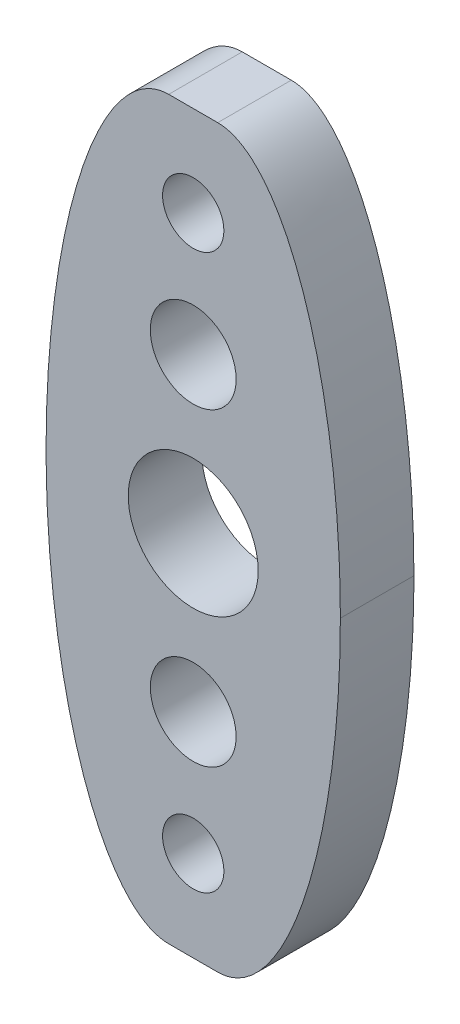
ISO-10303-21;
HEADER;
FILE_DESCRIPTION(('STEP AP214'),'2;1');
FILE_NAME('part.step','',(''),(''),'','','');
FILE_SCHEMA(('AUTOMOTIVE_DESIGN { 1 0 10303 214 1 1 1 1 }'));
ENDSEC;
DATA;
#1=APPLICATION_CONTEXT('core data for automotive mechanical design processes');
#2=APPLICATION_PROTOCOL_DEFINITION('international standard','automotive_design',2000,#1);
#3=PRODUCT_CONTEXT('',#1,'mechanical');
#4=PRODUCT('Part','Part','',(#3));
#5=PRODUCT_RELATED_PRODUCT_CATEGORY('part','',(#4));
#6=PRODUCT_DEFINITION_FORMATION('','',#4);
#7=PRODUCT_DEFINITION_CONTEXT('part definition',#1,'design');
#8=PRODUCT_DEFINITION('design','',#6,#7);
#9=PRODUCT_DEFINITION_SHAPE('','',#8);
#10=(LENGTH_UNIT() NAMED_UNIT(*) SI_UNIT(.MILLI.,.METRE.));
#11=(NAMED_UNIT(*) PLANE_ANGLE_UNIT() SI_UNIT($,.RADIAN.));
#12=(NAMED_UNIT(*) SI_UNIT($,.STERADIAN.) SOLID_ANGLE_UNIT());
#13=UNCERTAINTY_MEASURE_WITH_UNIT(LENGTH_MEASURE(1.E-05),#10,'distance_accuracy_value','');
#14=(GEOMETRIC_REPRESENTATION_CONTEXT(3) GLOBAL_UNCERTAINTY_ASSIGNED_CONTEXT((#13)) GLOBAL_UNIT_ASSIGNED_CONTEXT((#10,
#11,#12)) REPRESENTATION_CONTEXT('',''));
#15=CARTESIAN_POINT('',(0.,0.,0.));
#16=DIRECTION('',(0.,0.,1.));
#17=DIRECTION('',(1.,0.,0.));
#18=AXIS2_PLACEMENT_3D('',#15,#16,#17);
#19=CARTESIAN_POINT('',(0.,0.,3.));
#20=DIRECTION('',(0.,0.,1.));
#21=DIRECTION('',(1.,0.,0.));
#22=AXIS2_PLACEMENT_3D('',#19,#20,#21);
#23=PLANE('',#22);
#24=CARTESIAN_POINT('',(-4.76366496866908,1.25570615183316,3.));
#25=DIRECTION('',(0.,0.,1.));
#26=DIRECTION('',(-1.,0.,0.));
#27=AXIS2_PLACEMENT_3D('',#24,#25,#26);
#28=CIRCLE('',#27,1.25);
#29=CARTESIAN_POINT('',(-6.01366496866908,1.25570615183316,3.));
#30=VERTEX_POINT('',#29);
#31=EDGE_CURVE('E444',#30,#30,#28,.T.);
#32=ORIENTED_EDGE('',*,*,#31,.F.);
#33=EDGE_LOOP('',(#32));
#34=FACE_BOUND('',#33,.T.);
#35=CARTESIAN_POINT('',(-4.76366496866908,23.8757233922633,3.));
#36=DIRECTION('',(0.,0.,1.));
#37=DIRECTION('',(1.,0.,0.));
#38=AXIS2_PLACEMENT_3D('',#35,#36,#37);
#39=CIRCLE('',#38,1.25);
#40=CARTESIAN_POINT('',(-3.51366496866908,23.8757233922633,3.));
#41=VERTEX_POINT('',#40);
#42=EDGE_CURVE('E428',#41,#41,#39,.T.);
#43=ORIENTED_EDGE('',*,*,#42,.F.);
#44=EDGE_LOOP('',(#43));
#45=FACE_BOUND('',#44,.T.);
#46=DIRECTION('',(1.,0.,0.));
#47=VECTOR('',#46,1.);
#48=CARTESIAN_POINT('',(-10.7636649686691,-2.4342852279518,3.));
#49=LINE('',#48,#47);
#50=CARTESIAN_POINT('',(-5.76366496866908,-2.4342852279518,3.));
#51=VERTEX_POINT('',#50);
#52=CARTESIAN_POINT('',(-3.76366496866907,-2.4342852279518,3.));
#53=VERTEX_POINT('',#52);
#54=EDGE_CURVE('E307',#51,#53,#49,.T.);
#55=ORIENTED_EDGE('',*,*,#54,.T.);
#56=CARTESIAN_POINT('',(1.23633503133092,12.5657147720482,3.));
#57=CARTESIAN_POINT('',(1.23633503133092,-2.43428522795179,3.));
#58=CARTESIAN_POINT('',(-3.76366496866907,-2.43428522795179,3.));
#59=(BOUNDED_CURVE() B_SPLINE_CURVE(2,(#56,#57,#58),.UNSPECIFIED.,.F.,
.F.) B_SPLINE_CURVE_WITH_KNOTS((3,3),(0.,1.),
.UNSPECIFIED.) CURVE() GEOMETRIC_REPRESENTATION_ITEM() RATIONAL_B_SPLINE_CURVE((1.,
0.707106781186548,1.)) REPRESENTATION_ITEM(''));
#60=CARTESIAN_POINT('',(1.23633503133092,12.5657147720482,3.));
#61=VERTEX_POINT('',#60);
#62=EDGE_CURVE('E12',#53,#61,#59,.F.);
#63=ORIENTED_EDGE('',*,*,#62,.T.);
#64=CARTESIAN_POINT('',(-3.76366496866908,27.5657147720482,3.));
#65=CARTESIAN_POINT('',(1.23633503133092,27.5657147720482,3.));
#66=CARTESIAN_POINT('',(1.23633503133092,12.5657147720482,3.));
#67=(BOUNDED_CURVE() B_SPLINE_CURVE(2,(#64,#65,#66),.UNSPECIFIED.,.F.,
.F.) B_SPLINE_CURVE_WITH_KNOTS((3,3),(0.,1.),
.UNSPECIFIED.) CURVE() GEOMETRIC_REPRESENTATION_ITEM() RATIONAL_B_SPLINE_CURVE((1.,
0.707106781186547,1.)) REPRESENTATION_ITEM(''));
#68=CARTESIAN_POINT('',(-3.76366496866909,27.5657147720482,3.));
#69=VERTEX_POINT('',#68);
#70=EDGE_CURVE('E365',#61,#69,#67,.F.);
#71=ORIENTED_EDGE('',*,*,#70,.T.);
#72=DIRECTION('',(-1.,0.,0.));
#73=VECTOR('',#72,1.);
#74=CARTESIAN_POINT('',(-10.7636649686691,27.5657147720482,3.));
#75=LINE('',#74,#73);
#76=CARTESIAN_POINT('',(-5.76366496866909,27.5657147720482,3.));
#77=VERTEX_POINT('',#76);
#78=EDGE_CURVE('E146',#69,#77,#75,.T.);
#79=ORIENTED_EDGE('',*,*,#78,.T.);
#80=CARTESIAN_POINT('',(-10.7636649686691,12.5657147720482,3.));
#81=CARTESIAN_POINT('',(-10.7636649686691,27.5657147720482,3.));
#82=CARTESIAN_POINT('',(-5.76366496866909,27.5657147720482,3.));
#83=(BOUNDED_CURVE() B_SPLINE_CURVE(2,(#80,#81,#82),.UNSPECIFIED.,.F.,
.F.) B_SPLINE_CURVE_WITH_KNOTS((3,3),(0.,1.),
.UNSPECIFIED.) CURVE() GEOMETRIC_REPRESENTATION_ITEM() RATIONAL_B_SPLINE_CURVE((1.,
0.707106781186548,1.)) REPRESENTATION_ITEM(''));
#84=CARTESIAN_POINT('',(-10.7636649686691,12.5657147720482,3.));
#85=VERTEX_POINT('',#84);
#86=EDGE_CURVE('E358',#77,#85,#83,.F.);
#87=ORIENTED_EDGE('',*,*,#86,.T.);
#88=CARTESIAN_POINT('',(-5.76366496866908,-2.4342852279518,3.));
#89=CARTESIAN_POINT('',(-10.7636649686691,-2.4342852279518,3.));
#90=CARTESIAN_POINT('',(-10.7636649686691,12.5657147720482,3.));
#91=(BOUNDED_CURVE() B_SPLINE_CURVE(2,(#88,#89,#90),.UNSPECIFIED.,.F.,
.F.) B_SPLINE_CURVE_WITH_KNOTS((3,3),(0.,1.),
.UNSPECIFIED.) CURVE() GEOMETRIC_REPRESENTATION_ITEM() RATIONAL_B_SPLINE_CURVE((1.,
0.707106781186547,1.)) REPRESENTATION_ITEM(''));
#92=EDGE_CURVE('E124',#85,#51,#91,.F.);
#93=ORIENTED_EDGE('',*,*,#92,.T.);
#94=EDGE_LOOP('',(#55,#63,#71,#79,#87,#93));
#95=FACE_BOUND('',#94,.T.);
#96=CARTESIAN_POINT('',(-4.76366496866908,12.5657147720482,3.));
#97=DIRECTION('',(0.,0.,1.));
#98=DIRECTION('',(1.,0.,0.));
#99=AXIS2_PLACEMENT_3D('',#96,#97,#98);
#100=CIRCLE('',#99,2.65);
#101=CARTESIAN_POINT('',(-2.11366496866908,12.5657147720482,3.));
#102=VERTEX_POINT('',#101);
#103=EDGE_CURVE('E419',#102,#102,#100,.T.);
#104=ORIENTED_EDGE('',*,*,#103,.F.);
#105=EDGE_LOOP('',(#104));
#106=FACE_BOUND('',#105,.T.);
#107=CARTESIAN_POINT('',(-4.76366496866908,18.875154810515,3.));
#108=DIRECTION('',(0.,0.,1.));
#109=DIRECTION('',(1.,0.,0.));
#110=AXIS2_PLACEMENT_3D('',#107,#108,#109);
#111=CIRCLE('',#110,1.75);
#112=CARTESIAN_POINT('',(-3.01366496866908,18.875154810515,3.));
#113=VERTEX_POINT('',#112);
#114=EDGE_CURVE('E436',#113,#113,#111,.T.);
#115=ORIENTED_EDGE('',*,*,#114,.F.);
#116=EDGE_LOOP('',(#115));
#117=FACE_BOUND('',#116,.T.);
#118=CARTESIAN_POINT('',(-4.76366496866908,6.25627473358145,3.));
#119=DIRECTION('',(0.,0.,1.));
#120=DIRECTION('',(-1.,0.,0.));
#121=AXIS2_PLACEMENT_3D('',#118,#119,#120);
#122=CIRCLE('',#121,1.75);
#123=CARTESIAN_POINT('',(-6.51366496866908,6.25627473358145,3.));
#124=VERTEX_POINT('',#123);
#125=EDGE_CURVE('E452',#124,#124,#122,.T.);
#126=ORIENTED_EDGE('',*,*,#125,.F.);
#127=EDGE_LOOP('',(#126));
#128=FACE_BOUND('',#127,.T.);
#129=ADVANCED_FACE('F48',(#34,#45,#95,#106,#117,#128),#23,.T.);
#130=CARTESIAN_POINT('',(0.,0.,0.));
#131=DIRECTION('',(0.,0.,1.));
#132=DIRECTION('',(1.,0.,0.));
#133=AXIS2_PLACEMENT_3D('',#130,#131,#132);
#134=PLANE('',#133);
#135=CARTESIAN_POINT('',(1.23633503133092,12.5657147720482,0.));
#136=CARTESIAN_POINT('',(1.23633503133092,27.5657147720482,0.));
#137=CARTESIAN_POINT('',(-3.76366496866908,27.5657147720482,0.));
#138=(BOUNDED_CURVE() B_SPLINE_CURVE(2,(#135,#136,#137),.UNSPECIFIED.,.F.,
.F.) B_SPLINE_CURVE_WITH_KNOTS((3,3),(0.,1.),
.UNSPECIFIED.) CURVE() GEOMETRIC_REPRESENTATION_ITEM() RATIONAL_B_SPLINE_CURVE((1.,
0.707106781186547,1.)) REPRESENTATION_ITEM(''));
#139=CARTESIAN_POINT('',(-3.76366496866908,27.5657147720482,0.));
#140=VERTEX_POINT('',#139);
#141=CARTESIAN_POINT('',(1.23633503133092,12.5657147720482,0.));
#142=VERTEX_POINT('',#141);
#143=EDGE_CURVE('E372',#140,#142,#138,.F.);
#144=ORIENTED_EDGE('',*,*,#143,.T.);
#145=CARTESIAN_POINT('',(-3.76366496866907,-2.4342852279518,0.));
#146=CARTESIAN_POINT('',(1.23633503133092,-2.43428522795179,0.));
#147=CARTESIAN_POINT('',(1.23633503133092,12.5657147720482,0.));
#148=(BOUNDED_CURVE() B_SPLINE_CURVE(2,(#145,#146,#147),.UNSPECIFIED.,.F.,
.F.) B_SPLINE_CURVE_WITH_KNOTS((3,3),(0.,1.),
.UNSPECIFIED.) CURVE() GEOMETRIC_REPRESENTATION_ITEM() RATIONAL_B_SPLINE_CURVE((1.,
0.707106781186548,1.)) REPRESENTATION_ITEM(''));
#149=CARTESIAN_POINT('',(-3.76366496866907,-2.4342852279518,0.));
#150=VERTEX_POINT('',#149);
#151=EDGE_CURVE('E78',#142,#150,#148,.F.);
#152=ORIENTED_EDGE('',*,*,#151,.T.);
#153=DIRECTION('',(1.,0.,0.));
#154=VECTOR('',#153,1.);
#155=CARTESIAN_POINT('',(-10.7636649686691,-2.4342852279518,0.));
#156=LINE('',#155,#154);
#157=CARTESIAN_POINT('',(-5.76366496866908,-2.4342852279518,0.));
#158=VERTEX_POINT('',#157);
#159=EDGE_CURVE('E117',#158,#150,#156,.T.);
#160=ORIENTED_EDGE('',*,*,#159,.F.);
#161=CARTESIAN_POINT('',(-10.7636649686691,12.5657147720482,0.));
#162=CARTESIAN_POINT('',(-10.7636649686691,-2.4342852279518,0.));
#163=CARTESIAN_POINT('',(-5.76366496866908,-2.4342852279518,0.));
#164=(BOUNDED_CURVE() B_SPLINE_CURVE(2,(#161,#162,#163),.UNSPECIFIED.,.F.,
.F.) B_SPLINE_CURVE_WITH_KNOTS((3,3),(0.,1.),
.UNSPECIFIED.) CURVE() GEOMETRIC_REPRESENTATION_ITEM() RATIONAL_B_SPLINE_CURVE((1.,
0.707106781186547,1.)) REPRESENTATION_ITEM(''));
#165=CARTESIAN_POINT('',(-10.7636649686691,12.5657147720482,0.));
#166=VERTEX_POINT('',#165);
#167=EDGE_CURVE('E108',#158,#166,#164,.F.);
#168=ORIENTED_EDGE('',*,*,#167,.T.);
#169=CARTESIAN_POINT('',(-5.76366496866909,27.5657147720482,0.));
#170=CARTESIAN_POINT('',(-10.7636649686691,27.5657147720482,0.));
#171=CARTESIAN_POINT('',(-10.7636649686691,12.5657147720482,0.));
#172=(BOUNDED_CURVE() B_SPLINE_CURVE(2,(#169,#170,#171),.UNSPECIFIED.,.F.,
.F.) B_SPLINE_CURVE_WITH_KNOTS((3,3),(0.,1.),
.UNSPECIFIED.) CURVE() GEOMETRIC_REPRESENTATION_ITEM() RATIONAL_B_SPLINE_CURVE((1.,
0.707106781186548,1.)) REPRESENTATION_ITEM(''));
#173=CARTESIAN_POINT('',(-5.76366496866909,27.5657147720482,0.));
#174=VERTEX_POINT('',#173);
#175=EDGE_CURVE('E114',#166,#174,#172,.F.);
#176=ORIENTED_EDGE('',*,*,#175,.T.);
#177=DIRECTION('',(-1.,0.,0.));
#178=VECTOR('',#177,1.);
#179=CARTESIAN_POINT('',(-10.7636649686691,27.5657147720482,0.));
#180=LINE('',#179,#178);
#181=EDGE_CURVE('E298',#140,#174,#180,.T.);
#182=ORIENTED_EDGE('',*,*,#181,.F.);
#183=EDGE_LOOP('',(#144,#152,#160,#168,#176,#182));
#184=FACE_BOUND('',#183,.T.);
#185=CARTESIAN_POINT('',(-4.76366496866908,12.5657147720482,0.));
#186=DIRECTION('',(0.,0.,1.));
#187=DIRECTION('',(1.,0.,0.));
#188=AXIS2_PLACEMENT_3D('',#185,#186,#187);
#189=CIRCLE('',#188,2.65);
#190=CARTESIAN_POINT('',(-2.11366496866908,12.5657147720482,0.));
#191=VERTEX_POINT('',#190);
#192=EDGE_CURVE('E423',#191,#191,#189,.T.);
#193=ORIENTED_EDGE('',*,*,#192,.T.);
#194=EDGE_LOOP('',(#193));
#195=FACE_BOUND('',#194,.T.);
#196=CARTESIAN_POINT('',(-4.76366496866908,23.8757233922633,0.));
#197=DIRECTION('',(0.,0.,1.));
#198=DIRECTION('',(1.,0.,0.));
#199=AXIS2_PLACEMENT_3D('',#196,#197,#198);
#200=CIRCLE('',#199,1.25);
#201=CARTESIAN_POINT('',(-3.51366496866908,23.8757233922633,0.));
#202=VERTEX_POINT('',#201);
#203=EDGE_CURVE('E432',#202,#202,#200,.T.);
#204=ORIENTED_EDGE('',*,*,#203,.T.);
#205=EDGE_LOOP('',(#204));
#206=FACE_BOUND('',#205,.T.);
#207=CARTESIAN_POINT('',(-4.76366496866908,18.875154810515,0.));
#208=DIRECTION('',(0.,0.,1.));
#209=DIRECTION('',(1.,0.,0.));
#210=AXIS2_PLACEMENT_3D('',#207,#208,#209);
#211=CIRCLE('',#210,1.75);
#212=CARTESIAN_POINT('',(-3.01366496866908,18.875154810515,0.));
#213=VERTEX_POINT('',#212);
#214=EDGE_CURVE('E440',#213,#213,#211,.T.);
#215=ORIENTED_EDGE('',*,*,#214,.T.);
#216=EDGE_LOOP('',(#215));
#217=FACE_BOUND('',#216,.T.);
#218=CARTESIAN_POINT('',(-4.76366496866908,1.25570615183316,0.));
#219=DIRECTION('',(0.,0.,1.));
#220=DIRECTION('',(-1.,0.,0.));
#221=AXIS2_PLACEMENT_3D('',#218,#219,#220);
#222=CIRCLE('',#221,1.25);
#223=CARTESIAN_POINT('',(-6.01366496866908,1.25570615183316,0.));
#224=VERTEX_POINT('',#223);
#225=EDGE_CURVE('E448',#224,#224,#222,.T.);
#226=ORIENTED_EDGE('',*,*,#225,.T.);
#227=EDGE_LOOP('',(#226));
#228=FACE_BOUND('',#227,.T.);
#229=CARTESIAN_POINT('',(-4.76366496866908,6.25627473358145,0.));
#230=DIRECTION('',(0.,0.,1.));
#231=DIRECTION('',(-1.,0.,0.));
#232=AXIS2_PLACEMENT_3D('',#229,#230,#231);
#233=CIRCLE('',#232,1.75);
#234=CARTESIAN_POINT('',(-6.51366496866908,6.25627473358145,0.));
#235=VERTEX_POINT('',#234);
#236=EDGE_CURVE('E456',#235,#235,#233,.T.);
#237=ORIENTED_EDGE('',*,*,#236,.T.);
#238=EDGE_LOOP('',(#237));
#239=FACE_BOUND('',#238,.T.);
#240=ADVANCED_FACE('F111',(#184,#195,#206,#217,#228,#239),#134,.F.);
#241=CARTESIAN_POINT('',(-10.7636649686691,-2.4342852279518,3.));
#242=DIRECTION('',(0.,1.,0.));
#243=DIRECTION('',(-1.,0.,0.));
#244=AXIS2_PLACEMENT_3D('',#241,#242,#243);
#245=PLANE('',#244);
#246=ORIENTED_EDGE('',*,*,#159,.T.);
#247=CARTESIAN_POINT('',(-3.76366496866907,-2.4342852279518,3.15));
#248=CARTESIAN_POINT('',(-3.76366496866907,-2.4342852279518,2.05));
#249=CARTESIAN_POINT('',(-3.76366496866907,-2.4342852279518,0.95));
#250=CARTESIAN_POINT('',(-3.76366496866907,-2.4342852279518,-0.15));
#251=(BOUNDED_CURVE() B_SPLINE_CURVE(3,(#247,#248,#249,#250),.UNSPECIFIED.,.F.,
.F.) B_SPLINE_CURVE_WITH_KNOTS((4,4),(-0.00015,0.00315),
.UNSPECIFIED.) CURVE() GEOMETRIC_REPRESENTATION_ITEM() RATIONAL_B_SPLINE_CURVE((1.,1.,1.,1.)) REPRESENTATION_ITEM(''));
#252=EDGE_CURVE('E63',#150,#53,#251,.F.);
#253=ORIENTED_EDGE('',*,*,#252,.T.);
#254=ORIENTED_EDGE('',*,*,#54,.F.);
#255=CARTESIAN_POINT('',(-5.76366496866908,-2.4342852279518,-0.15));
#256=CARTESIAN_POINT('',(-5.76366496866908,-2.4342852279518,0.95));
#257=CARTESIAN_POINT('',(-5.76366496866908,-2.4342852279518,2.05));
#258=CARTESIAN_POINT('',(-5.76366496866908,-2.4342852279518,3.15));
#259=(BOUNDED_CURVE() B_SPLINE_CURVE(3,(#255,#256,#257,#258),.UNSPECIFIED.,.F.,
.F.) B_SPLINE_CURVE_WITH_KNOTS((4,4),(-0.00015,0.00315),
.UNSPECIFIED.) CURVE() GEOMETRIC_REPRESENTATION_ITEM() RATIONAL_B_SPLINE_CURVE((1.,1.,1.,1.)) REPRESENTATION_ITEM(''));
#260=EDGE_CURVE('E125',#51,#158,#259,.F.);
#261=ORIENTED_EDGE('',*,*,#260,.T.);
#262=EDGE_LOOP('',(#246,#253,#254,#261));
#263=FACE_BOUND('',#262,.T.);
#264=ADVANCED_FACE('F265',(#263),#245,.F.);
#265=CARTESIAN_POINT('',(-10.7636649686691,27.5657147720482,3.));
#266=DIRECTION('',(0.,-1.,0.));
#267=DIRECTION('',(1.,0.,0.));
#268=AXIS2_PLACEMENT_3D('',#265,#266,#267);
#269=PLANE('',#268);
#270=ORIENTED_EDGE('',*,*,#78,.F.);
#271=CARTESIAN_POINT('',(-3.76366496866908,27.5657147720482,-0.15));
#272=CARTESIAN_POINT('',(-3.76366496866908,27.5657147720482,0.95));
#273=CARTESIAN_POINT('',(-3.76366496866908,27.5657147720482,2.05));
#274=CARTESIAN_POINT('',(-3.76366496866908,27.5657147720482,3.15));
#275=(BOUNDED_CURVE() B_SPLINE_CURVE(3,(#271,#272,#273,#274),.UNSPECIFIED.,.F.,
.F.) B_SPLINE_CURVE_WITH_KNOTS((4,4),(-0.00015,0.00315),
.UNSPECIFIED.) CURVE() GEOMETRIC_REPRESENTATION_ITEM() RATIONAL_B_SPLINE_CURVE((1.,1.,1.,1.)) REPRESENTATION_ITEM(''));
#276=EDGE_CURVE('E377',#69,#140,#275,.F.);
#277=ORIENTED_EDGE('',*,*,#276,.T.);
#278=ORIENTED_EDGE('',*,*,#181,.T.);
#279=CARTESIAN_POINT('',(-5.76366496866909,27.5657147720482,3.15));
#280=CARTESIAN_POINT('',(-5.76366496866909,27.5657147720482,2.05));
#281=CARTESIAN_POINT('',(-5.76366496866909,27.5657147720482,0.95));
#282=CARTESIAN_POINT('',(-5.76366496866909,27.5657147720482,-0.15));
#283=(BOUNDED_CURVE() B_SPLINE_CURVE(3,(#279,#280,#281,#282),.UNSPECIFIED.,.F.,
.F.) B_SPLINE_CURVE_WITH_KNOTS((4,4),(-0.00015,0.00315),
.UNSPECIFIED.) CURVE() GEOMETRIC_REPRESENTATION_ITEM() RATIONAL_B_SPLINE_CURVE((1.,1.,1.,1.)) REPRESENTATION_ITEM(''));
#284=EDGE_CURVE('E137',#174,#77,#283,.F.);
#285=ORIENTED_EDGE('',*,*,#284,.T.);
#286=EDGE_LOOP('',(#270,#277,#278,#285));
#287=FACE_BOUND('',#286,.T.);
#288=ADVANCED_FACE('F329',(#287),#269,.F.);
#289=CARTESIAN_POINT('',(-4.76366496866908,12.5657147720482,3.));
#290=DIRECTION('',(0.,0.,-1.));
#291=DIRECTION('',(-1.,0.,0.));
#292=AXIS2_PLACEMENT_3D('',#289,#290,#291);
#293=CYLINDRICAL_SURFACE('',#292,2.65);
#294=ORIENTED_EDGE('',*,*,#103,.T.);
#295=EDGE_LOOP('',(#294));
#296=FACE_BOUND('',#295,.T.);
#297=ORIENTED_EDGE('',*,*,#192,.F.);
#298=EDGE_LOOP('',(#297));
#299=FACE_BOUND('',#298,.T.);
#300=ADVANCED_FACE('F478',(#296,#299),#293,.F.);
#301=CARTESIAN_POINT('',(-4.76366496866908,23.8757233922633,3.));
#302=DIRECTION('',(0.,0.,-1.));
#303=DIRECTION('',(-1.,0.,0.));
#304=AXIS2_PLACEMENT_3D('',#301,#302,#303);
#305=CYLINDRICAL_SURFACE('',#304,1.25);
#306=ORIENTED_EDGE('',*,*,#42,.T.);
#307=EDGE_LOOP('',(#306));
#308=FACE_BOUND('',#307,.T.);
#309=ORIENTED_EDGE('',*,*,#203,.F.);
#310=EDGE_LOOP('',(#309));
#311=FACE_BOUND('',#310,.T.);
#312=ADVANCED_FACE('F474',(#308,#311),#305,.F.);
#313=CARTESIAN_POINT('',(-4.76366496866908,18.875154810515,3.));
#314=DIRECTION('',(0.,0.,-1.));
#315=DIRECTION('',(-1.,0.,0.));
#316=AXIS2_PLACEMENT_3D('',#313,#314,#315);
#317=CYLINDRICAL_SURFACE('',#316,1.75);
#318=ORIENTED_EDGE('',*,*,#114,.T.);
#319=EDGE_LOOP('',(#318));
#320=FACE_BOUND('',#319,.T.);
#321=ORIENTED_EDGE('',*,*,#214,.F.);
#322=EDGE_LOOP('',(#321));
#323=FACE_BOUND('',#322,.T.);
#324=ADVANCED_FACE('F477',(#320,#323),#317,.F.);
#325=CARTESIAN_POINT('',(-4.76366496866908,1.25570615183316,3.));
#326=DIRECTION('',(0.,0.,-1.));
#327=DIRECTION('',(-1.,0.,0.));
#328=AXIS2_PLACEMENT_3D('',#325,#326,#327);
#329=CYLINDRICAL_SURFACE('',#328,1.25);
#330=ORIENTED_EDGE('',*,*,#31,.T.);
#331=EDGE_LOOP('',(#330));
#332=FACE_BOUND('',#331,.T.);
#333=ORIENTED_EDGE('',*,*,#225,.F.);
#334=EDGE_LOOP('',(#333));
#335=FACE_BOUND('',#334,.T.);
#336=ADVANCED_FACE('F489',(#332,#335),#329,.F.);
#337=CARTESIAN_POINT('',(-4.76366496866908,6.25627473358145,3.));
#338=DIRECTION('',(0.,0.,-1.));
#339=DIRECTION('',(-1.,0.,0.));
#340=AXIS2_PLACEMENT_3D('',#337,#338,#339);
#341=CYLINDRICAL_SURFACE('',#340,1.75);
#342=ORIENTED_EDGE('',*,*,#125,.T.);
#343=EDGE_LOOP('',(#342));
#344=FACE_BOUND('',#343,.T.);
#345=ORIENTED_EDGE('',*,*,#236,.F.);
#346=EDGE_LOOP('',(#345));
#347=FACE_BOUND('',#346,.T.);
#348=ADVANCED_FACE('F264',(#344,#347),#341,.F.);
#349=CARTESIAN_POINT('',(-10.7636649686691,12.5657147720482,3.15));
#350=CARTESIAN_POINT('',(-10.7636649686691,12.5657147720482,2.05));
#351=CARTESIAN_POINT('',(-10.7636649686691,12.5657147720482,0.95));
#352=CARTESIAN_POINT('',(-10.7636649686691,12.5657147720482,-0.15));
#353=CARTESIAN_POINT('',(-10.7636649686691,27.5657147720482,3.15));
#354=CARTESIAN_POINT('',(-10.7636649686691,27.5657147720482,2.05));
#355=CARTESIAN_POINT('',(-10.7636649686691,27.5657147720482,0.949999999999999));
#356=CARTESIAN_POINT('',(-10.7636649686691,27.5657147720482,-0.15));
#357=CARTESIAN_POINT('',(-5.76366496866909,27.5657147720482,3.15));
#358=CARTESIAN_POINT('',(-5.76366496866909,27.5657147720482,2.05));
#359=CARTESIAN_POINT('',(-5.76366496866909,27.5657147720482,0.95));
#360=CARTESIAN_POINT('',(-5.76366496866909,27.5657147720482,-0.15));
#361=(BOUNDED_SURFACE() B_SPLINE_SURFACE(2,3,((#349,#350,#351,#352),(#353,#354,#355,#356),(#357,
#358,#359,#360)),.UNSPECIFIED.,.F.,.F.,.F.) B_SPLINE_SURFACE_WITH_KNOTS((3,3),(4,4),(0.,1.),
(-0.00015,0.00315),
.UNSPECIFIED.) GEOMETRIC_REPRESENTATION_ITEM() RATIONAL_B_SPLINE_SURFACE(((1.,1.,1.,1.),
(0.707106781186548,0.707106781186548,0.707106781186548,0.707106781186548),(1.,1.,1.,1.))) REPRESENTATION_ITEM('') SURFACE());
#362=CARTESIAN_POINT('',(-10.7636649686691,12.5657147720482,3.15));
#363=CARTESIAN_POINT('',(-10.7636649686691,12.5657147720482,2.05));
#364=CARTESIAN_POINT('',(-10.7636649686691,12.5657147720482,0.95));
#365=CARTESIAN_POINT('',(-10.7636649686691,12.5657147720482,-0.15));
#366=(BOUNDED_CURVE() B_SPLINE_CURVE(3,(#362,#363,#364,#365),.UNSPECIFIED.,.F.,
.F.) B_SPLINE_CURVE_WITH_KNOTS((4,4),(-0.00015,0.00315),
.UNSPECIFIED.) CURVE() GEOMETRIC_REPRESENTATION_ITEM() RATIONAL_B_SPLINE_CURVE((1.,1.,1.,1.)) REPRESENTATION_ITEM(''));
#367=EDGE_CURVE('E133',#85,#166,#366,.T.);
#368=ORIENTED_EDGE('',*,*,#86,.F.);
#369=ORIENTED_EDGE('',*,*,#284,.F.);
#370=ORIENTED_EDGE('',*,*,#175,.F.);
#371=ORIENTED_EDGE('',*,*,#367,.F.);
#372=EDGE_LOOP('',(#368,#369,#370,#371));
#373=FACE_BOUND('',#372,.T.);
#374=ADVANCED_FACE('F132',(#373),#361,.T.);
#375=CARTESIAN_POINT('',(-3.76366496866908,27.5657147720482,3.15));
#376=CARTESIAN_POINT('',(-3.76366496866908,27.5657147720482,2.05));
#377=CARTESIAN_POINT('',(-3.76366496866908,27.5657147720482,0.95));
#378=CARTESIAN_POINT('',(-3.76366496866908,27.5657147720482,-0.15));
#379=CARTESIAN_POINT('',(1.23633503133092,27.5657147720482,3.15));
#380=CARTESIAN_POINT('',(1.23633503133092,27.5657147720482,2.05));
#381=CARTESIAN_POINT('',(1.23633503133092,27.5657147720482,0.949999999999999));
#382=CARTESIAN_POINT('',(1.23633503133092,27.5657147720482,-0.15));
#383=CARTESIAN_POINT('',(1.23633503133092,12.5657147720482,3.15));
#384=CARTESIAN_POINT('',(1.23633503133092,12.5657147720482,2.05));
#385=CARTESIAN_POINT('',(1.23633503133092,12.5657147720482,0.95));
#386=CARTESIAN_POINT('',(1.23633503133092,12.5657147720482,-0.15));
#387=(BOUNDED_SURFACE() B_SPLINE_SURFACE(2,3,((#375,#376,#377,#378),(#379,#380,#381,#382),(#383,
#384,#385,#386)),.UNSPECIFIED.,.F.,.F.,.F.) B_SPLINE_SURFACE_WITH_KNOTS((3,3),(4,4),(0.,1.),
(-0.00015,0.00315),
.UNSPECIFIED.) GEOMETRIC_REPRESENTATION_ITEM() RATIONAL_B_SPLINE_SURFACE(((1.,1.,1.,1.),
(0.707106781186547,0.707106781186547,0.707106781186547,0.707106781186547),(1.,1.,1.,1.))) REPRESENTATION_ITEM('') SURFACE());
#388=CARTESIAN_POINT('',(1.23633503133092,12.5657147720482,-0.15));
#389=CARTESIAN_POINT('',(1.23633503133092,12.5657147720482,0.95));
#390=CARTESIAN_POINT('',(1.23633503133092,12.5657147720482,2.05));
#391=CARTESIAN_POINT('',(1.23633503133092,12.5657147720482,3.15));
#392=(BOUNDED_CURVE() B_SPLINE_CURVE(3,(#388,#389,#390,#391),.UNSPECIFIED.,.F.,
.F.) B_SPLINE_CURVE_WITH_KNOTS((4,4),(-0.00015,0.00315),
.UNSPECIFIED.) CURVE() GEOMETRIC_REPRESENTATION_ITEM() RATIONAL_B_SPLINE_CURVE((1.,1.,1.,1.)) REPRESENTATION_ITEM(''));
#393=EDGE_CURVE('E367',#142,#61,#392,.T.);
#394=ORIENTED_EDGE('',*,*,#70,.F.);
#395=ORIENTED_EDGE('',*,*,#393,.F.);
#396=ORIENTED_EDGE('',*,*,#143,.F.);
#397=ORIENTED_EDGE('',*,*,#276,.F.);
#398=EDGE_LOOP('',(#394,#395,#396,#397));
#399=FACE_BOUND('',#398,.T.);
#400=ADVANCED_FACE('F168',(#399),#387,.T.);
#401=CARTESIAN_POINT('',(-5.76366496866908,-2.4342852279518,3.15));
#402=CARTESIAN_POINT('',(-5.76366496866908,-2.4342852279518,2.05));
#403=CARTESIAN_POINT('',(-5.76366496866908,-2.4342852279518,0.95));
#404=CARTESIAN_POINT('',(-5.76366496866908,-2.4342852279518,-0.15));
#405=CARTESIAN_POINT('',(-10.7636649686691,-2.4342852279518,3.15));
#406=CARTESIAN_POINT('',(-10.7636649686691,-2.4342852279518,2.05));
#407=CARTESIAN_POINT('',(-10.7636649686691,-2.4342852279518,0.949999999999999));
#408=CARTESIAN_POINT('',(-10.7636649686691,-2.4342852279518,-0.15));
#409=CARTESIAN_POINT('',(-10.7636649686691,12.5657147720482,3.15));
#410=CARTESIAN_POINT('',(-10.7636649686691,12.5657147720482,2.05));
#411=CARTESIAN_POINT('',(-10.7636649686691,12.5657147720482,0.95));
#412=CARTESIAN_POINT('',(-10.7636649686691,12.5657147720482,-0.15));
#413=(BOUNDED_SURFACE() B_SPLINE_SURFACE(2,3,((#401,#402,#403,#404),(#405,#406,#407,#408),(#409,
#410,#411,#412)),.UNSPECIFIED.,.F.,.F.,.F.) B_SPLINE_SURFACE_WITH_KNOTS((3,3),(4,4),(0.,1.),
(-0.00015,0.00315),
.UNSPECIFIED.) GEOMETRIC_REPRESENTATION_ITEM() RATIONAL_B_SPLINE_SURFACE(((1.,1.,1.,1.),
(0.707106781186547,0.707106781186547,0.707106781186547,0.707106781186547),(1.,1.,1.,1.))) REPRESENTATION_ITEM('') SURFACE());
#414=ORIENTED_EDGE('',*,*,#92,.F.);
#415=ORIENTED_EDGE('',*,*,#367,.T.);
#416=ORIENTED_EDGE('',*,*,#167,.F.);
#417=ORIENTED_EDGE('',*,*,#260,.F.);
#418=EDGE_LOOP('',(#414,#415,#416,#417));
#419=FACE_BOUND('',#418,.T.);
#420=ADVANCED_FACE('F143',(#419),#413,.T.);
#421=CARTESIAN_POINT('',(1.23633503133092,12.5657147720482,3.15));
#422=CARTESIAN_POINT('',(1.23633503133092,12.5657147720482,2.05));
#423=CARTESIAN_POINT('',(1.23633503133092,12.5657147720482,0.95));
#424=CARTESIAN_POINT('',(1.23633503133092,12.5657147720482,-0.15));
#425=CARTESIAN_POINT('',(1.23633503133092,-2.43428522795179,3.15));
#426=CARTESIAN_POINT('',(1.23633503133092,-2.43428522795179,2.05));
#427=CARTESIAN_POINT('',(1.23633503133092,-2.43428522795179,0.949999999999999));
#428=CARTESIAN_POINT('',(1.23633503133092,-2.43428522795179,-0.15));
#429=CARTESIAN_POINT('',(-3.76366496866907,-2.4342852279518,3.15));
#430=CARTESIAN_POINT('',(-3.76366496866907,-2.4342852279518,2.05));
#431=CARTESIAN_POINT('',(-3.76366496866907,-2.4342852279518,0.95));
#432=CARTESIAN_POINT('',(-3.76366496866907,-2.4342852279518,-0.15));
#433=(BOUNDED_SURFACE() B_SPLINE_SURFACE(2,3,((#421,#422,#423,#424),(#425,#426,#427,#428),(#429,
#430,#431,#432)),.UNSPECIFIED.,.F.,.F.,.F.) B_SPLINE_SURFACE_WITH_KNOTS((3,3),(4,4),(0.,1.),
(-0.00015,0.00315),
.UNSPECIFIED.) GEOMETRIC_REPRESENTATION_ITEM() RATIONAL_B_SPLINE_SURFACE(((1.,1.,1.,1.),
(0.707106781186548,0.707106781186548,0.707106781186548,0.707106781186548),(1.,1.,1.,1.))) REPRESENTATION_ITEM('') SURFACE());
#434=ORIENTED_EDGE('',*,*,#62,.F.);
#435=ORIENTED_EDGE('',*,*,#252,.F.);
#436=ORIENTED_EDGE('',*,*,#151,.F.);
#437=ORIENTED_EDGE('',*,*,#393,.T.);
#438=EDGE_LOOP('',(#434,#435,#436,#437));
#439=FACE_BOUND('',#438,.T.);
#440=ADVANCED_FACE('F51',(#439),#433,.T.);
#441=CLOSED_SHELL('',(#129,#240,#264,#288,#300,#312,#324,#336,#348,#374,#400,#420,#440));
#442=MANIFOLD_SOLID_BREP('B2',#441);
#443=ADVANCED_BREP_SHAPE_REPRESENTATION('',(#18,#442),#14);
#444=SHAPE_DEFINITION_REPRESENTATION(#9,#443);
ENDSEC;
END-ISO-10303-21;
